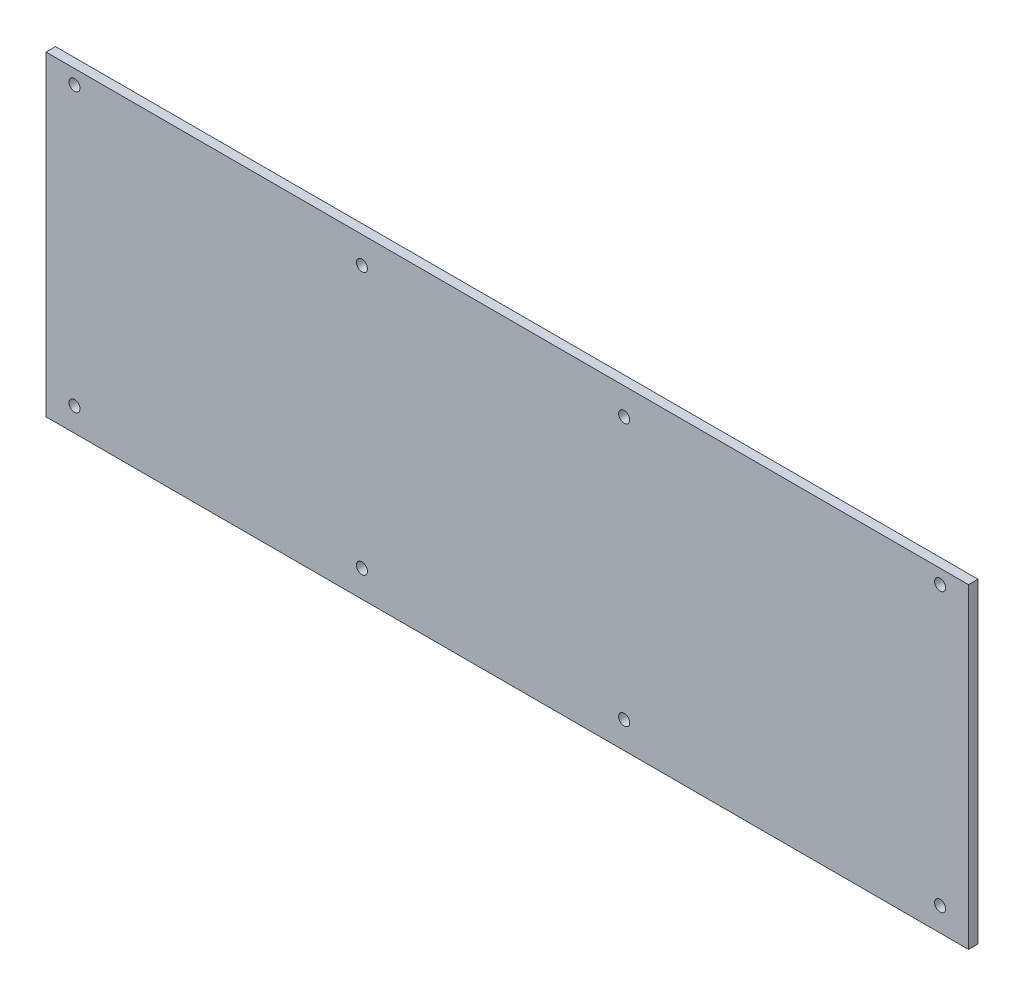
ISO-10303-21;
HEADER;
FILE_DESCRIPTION(('STEP AP214'),'2;1');
FILE_NAME('part.step','',(''),(''),'','','');
FILE_SCHEMA(('AUTOMOTIVE_DESIGN { 1 0 10303 214 1 1 1 1 }'));
ENDSEC;
DATA;
#1=APPLICATION_CONTEXT('core data for automotive mechanical design processes');
#2=APPLICATION_PROTOCOL_DEFINITION('international standard','automotive_design',2000,#1);
#3=PRODUCT_CONTEXT('',#1,'mechanical');
#4=PRODUCT('Part','Part','',(#3));
#5=PRODUCT_RELATED_PRODUCT_CATEGORY('part','',(#4));
#6=PRODUCT_DEFINITION_FORMATION('','',#4);
#7=PRODUCT_DEFINITION_CONTEXT('part definition',#1,'design');
#8=PRODUCT_DEFINITION('design','',#6,#7);
#9=PRODUCT_DEFINITION_SHAPE('','',#8);
#10=(LENGTH_UNIT() NAMED_UNIT(*) SI_UNIT(.MILLI.,.METRE.));
#11=(NAMED_UNIT(*) PLANE_ANGLE_UNIT() SI_UNIT($,.RADIAN.));
#12=(NAMED_UNIT(*) SI_UNIT($,.STERADIAN.) SOLID_ANGLE_UNIT());
#13=UNCERTAINTY_MEASURE_WITH_UNIT(LENGTH_MEASURE(1.E-05),#10,'distance_accuracy_value','');
#14=(GEOMETRIC_REPRESENTATION_CONTEXT(3) GLOBAL_UNCERTAINTY_ASSIGNED_CONTEXT((#13)) GLOBAL_UNIT_ASSIGNED_CONTEXT((#10,
#11,#12)) REPRESENTATION_CONTEXT('',''));
#15=CARTESIAN_POINT('',(0.,0.,0.));
#16=DIRECTION('',(0.,0.,1.));
#17=DIRECTION('',(1.,0.,0.));
#18=AXIS2_PLACEMENT_3D('',#15,#16,#17);
#19=CARTESIAN_POINT('',(0.,0.,3.));
#20=DIRECTION('',(0.,1.,0.));
#21=DIRECTION('',(0.,0.,1.));
#22=AXIS2_PLACEMENT_3D('',#19,#20,#21);
#23=PLANE('',#22);
#24=DIRECTION('',(1.,0.,0.));
#25=VECTOR('',#24,1.);
#26=CARTESIAN_POINT('',(0.,0.,3.));
#27=LINE('',#26,#25);
#28=CARTESIAN_POINT('',(7.99999999999999,0.,3.));
#29=VERTEX_POINT('',#28);
#30=CARTESIAN_POINT('',(300.,0.,3.));
#31=VERTEX_POINT('',#30);
#32=EDGE_CURVE('E92',#29,#31,#27,.T.);
#33=ORIENTED_EDGE('',*,*,#32,.F.);
#34=DIRECTION('',(0.,0.,-1.));
#35=VECTOR('',#34,1.);
#36=CARTESIAN_POINT('',(7.99999999999999,0.,10.));
#37=LINE('',#36,#35);
#38=CARTESIAN_POINT('',(7.99999999999999,0.,0.));
#39=VERTEX_POINT('',#38);
#40=EDGE_CURVE('E108',#29,#39,#37,.T.);
#41=ORIENTED_EDGE('',*,*,#40,.T.);
#42=DIRECTION('',(1.,0.,0.));
#43=VECTOR('',#42,1.);
#44=CARTESIAN_POINT('',(0.,0.,0.));
#45=LINE('',#44,#43);
#46=CARTESIAN_POINT('',(300.,0.,0.));
#47=VERTEX_POINT('',#46);
#48=EDGE_CURVE('E82',#39,#47,#45,.T.);
#49=ORIENTED_EDGE('',*,*,#48,.T.);
#50=DIRECTION('',(0.,0.,-1.));
#51=VECTOR('',#50,1.);
#52=CARTESIAN_POINT('',(300.,0.,3.));
#53=LINE('',#52,#51);
#54=EDGE_CURVE('E11',#31,#47,#53,.T.);
#55=ORIENTED_EDGE('',*,*,#54,.F.);
#56=EDGE_LOOP('',(#33,#41,#49,#55));
#57=FACE_BOUND('',#56,.T.);
#58=ADVANCED_FACE('F36',(#57),#23,.F.);
#59=CARTESIAN_POINT('',(300.,0.,3.));
#60=DIRECTION('',(-1.,0.,0.));
#61=DIRECTION('',(0.,0.,1.));
#62=AXIS2_PLACEMENT_3D('',#59,#60,#61);
#63=PLANE('',#62);
#64=DIRECTION('',(0.,1.,0.));
#65=VECTOR('',#64,1.);
#66=CARTESIAN_POINT('',(300.,0.,0.));
#67=LINE('',#66,#65);
#68=CARTESIAN_POINT('',(300.,100.,0.));
#69=VERTEX_POINT('',#68);
#70=EDGE_CURVE('E72',#47,#69,#67,.T.);
#71=ORIENTED_EDGE('',*,*,#70,.T.);
#72=DIRECTION('',(0.,0.,-1.));
#73=VECTOR('',#72,1.);
#74=CARTESIAN_POINT('',(300.,100.,3.));
#75=LINE('',#74,#73);
#76=CARTESIAN_POINT('',(300.,100.,3.));
#77=VERTEX_POINT('',#76);
#78=EDGE_CURVE('E44',#77,#69,#75,.T.);
#79=ORIENTED_EDGE('',*,*,#78,.F.);
#80=DIRECTION('',(0.,1.,0.));
#81=VECTOR('',#80,1.);
#82=CARTESIAN_POINT('',(300.,0.,3.));
#83=LINE('',#82,#81);
#84=EDGE_CURVE('E60',#31,#77,#83,.T.);
#85=ORIENTED_EDGE('',*,*,#84,.F.);
#86=ORIENTED_EDGE('',*,*,#54,.T.);
#87=EDGE_LOOP('',(#71,#79,#85,#86));
#88=FACE_BOUND('',#87,.T.);
#89=ADVANCED_FACE('F74',(#88),#63,.F.);
#90=CARTESIAN_POINT('',(0.,100.,3.));
#91=DIRECTION('',(0.,-1.,0.));
#92=DIRECTION('',(0.,0.,-1.));
#93=AXIS2_PLACEMENT_3D('',#90,#91,#92);
#94=PLANE('',#93);
#95=DIRECTION('',(-1.,0.,0.));
#96=VECTOR('',#95,1.);
#97=CARTESIAN_POINT('',(0.,100.,0.));
#98=LINE('',#97,#96);
#99=CARTESIAN_POINT('',(8.,100.,0.));
#100=VERTEX_POINT('',#99);
#101=EDGE_CURVE('E81',#69,#100,#98,.T.);
#102=ORIENTED_EDGE('',*,*,#101,.T.);
#103=DIRECTION('',(0.,0.,-1.));
#104=VECTOR('',#103,1.);
#105=CARTESIAN_POINT('',(8.,100.,10.));
#106=LINE('',#105,#104);
#107=CARTESIAN_POINT('',(8.,100.,3.));
#108=VERTEX_POINT('',#107);
#109=EDGE_CURVE('E51',#108,#100,#106,.T.);
#110=ORIENTED_EDGE('',*,*,#109,.F.);
#111=DIRECTION('',(-1.,0.,0.));
#112=VECTOR('',#111,1.);
#113=CARTESIAN_POINT('',(0.,100.,3.));
#114=LINE('',#113,#112);
#115=EDGE_CURVE('E87',#77,#108,#114,.T.);
#116=ORIENTED_EDGE('',*,*,#115,.F.);
#117=ORIENTED_EDGE('',*,*,#78,.T.);
#118=EDGE_LOOP('',(#102,#110,#116,#117));
#119=FACE_BOUND('',#118,.T.);
#120=ADVANCED_FACE('F86',(#119),#94,.F.);
#121=CARTESIAN_POINT('',(0.,0.,3.));
#122=DIRECTION('',(0.,0.,-1.));
#123=DIRECTION('',(-1.,0.,0.));
#124=AXIS2_PLACEMENT_3D('',#121,#122,#123);
#125=PLANE('',#124);
#126=CARTESIAN_POINT('',(191.,91.5,3.));
#127=DIRECTION('',(0.,0.,-1.));
#128=DIRECTION('',(1.,0.,0.));
#129=AXIS2_PLACEMENT_3D('',#126,#127,#128);
#130=CIRCLE('',#129,1.75000000000001);
#131=CARTESIAN_POINT('',(192.75,91.5,3.));
#132=VERTEX_POINT('',#131);
#133=EDGE_CURVE('E153',#132,#132,#130,.T.);
#134=ORIENTED_EDGE('',*,*,#133,.T.);
#135=EDGE_LOOP('',(#134));
#136=FACE_BOUND('',#135,.T.);
#137=CARTESIAN_POINT('',(191.,8.50000000000002,3.));
#138=DIRECTION('',(0.,0.,-1.));
#139=DIRECTION('',(-1.,0.,0.));
#140=AXIS2_PLACEMENT_3D('',#137,#138,#139);
#141=CIRCLE('',#140,1.75000000000001);
#142=CARTESIAN_POINT('',(189.25,8.50000000000002,3.));
#143=VERTEX_POINT('',#142);
#144=EDGE_CURVE('E169',#143,#143,#141,.T.);
#145=ORIENTED_EDGE('',*,*,#144,.T.);
#146=EDGE_LOOP('',(#145));
#147=FACE_BOUND('',#146,.T.);
#148=CARTESIAN_POINT('',(108.,8.50000000000002,3.));
#149=DIRECTION('',(0.,0.,-1.));
#150=DIRECTION('',(1.,0.,0.));
#151=AXIS2_PLACEMENT_3D('',#148,#149,#150);
#152=CIRCLE('',#151,1.75);
#153=CARTESIAN_POINT('',(109.75,8.50000000000002,3.));
#154=VERTEX_POINT('',#153);
#155=EDGE_CURVE('E161',#154,#154,#152,.T.);
#156=ORIENTED_EDGE('',*,*,#155,.T.);
#157=EDGE_LOOP('',(#156));
#158=FACE_BOUND('',#157,.T.);
#159=CARTESIAN_POINT('',(108.,91.5,3.));
#160=DIRECTION('',(0.,0.,-1.));
#161=DIRECTION('',(-1.,0.,0.));
#162=AXIS2_PLACEMENT_3D('',#159,#160,#161);
#163=CIRCLE('',#162,1.75);
#164=CARTESIAN_POINT('',(106.25,91.5,3.));
#165=VERTEX_POINT('',#164);
#166=EDGE_CURVE('E130',#165,#165,#163,.T.);
#167=ORIENTED_EDGE('',*,*,#166,.T.);
#168=EDGE_LOOP('',(#167));
#169=FACE_BOUND('',#168,.T.);
#170=CARTESIAN_POINT('',(17.,95.5,3.));
#171=DIRECTION('',(0.,0.,-1.));
#172=DIRECTION('',(1.,0.,0.));
#173=AXIS2_PLACEMENT_3D('',#170,#171,#172);
#174=CIRCLE('',#173,1.74999999999998);
#175=CARTESIAN_POINT('',(18.75,95.5,3.));
#176=VERTEX_POINT('',#175);
#177=EDGE_CURVE('E121',#176,#176,#174,.T.);
#178=ORIENTED_EDGE('',*,*,#177,.T.);
#179=EDGE_LOOP('',(#178));
#180=FACE_BOUND('',#179,.T.);
#181=CARTESIAN_POINT('',(17.,7.49999999999998,3.));
#182=DIRECTION('',(0.,0.,-1.));
#183=DIRECTION('',(-1.,0.,0.));
#184=AXIS2_PLACEMENT_3D('',#181,#182,#183);
#185=CIRCLE('',#184,1.74999999999998);
#186=CARTESIAN_POINT('',(15.25,7.49999999999998,3.));
#187=VERTEX_POINT('',#186);
#188=EDGE_CURVE('E138',#187,#187,#185,.T.);
#189=ORIENTED_EDGE('',*,*,#188,.T.);
#190=EDGE_LOOP('',(#189));
#191=FACE_BOUND('',#190,.T.);
#192=CARTESIAN_POINT('',(291.,7.49999999999994,3.));
#193=DIRECTION('',(0.,0.,-1.));
#194=DIRECTION('',(1.,0.,0.));
#195=AXIS2_PLACEMENT_3D('',#192,#193,#194);
#196=CIRCLE('',#195,1.74999999999998);
#197=CARTESIAN_POINT('',(292.75,7.49999999999994,3.));
#198=VERTEX_POINT('',#197);
#199=EDGE_CURVE('E129',#198,#198,#196,.T.);
#200=ORIENTED_EDGE('',*,*,#199,.T.);
#201=EDGE_LOOP('',(#200));
#202=FACE_BOUND('',#201,.T.);
#203=CARTESIAN_POINT('',(291.,95.5,3.));
#204=DIRECTION('',(0.,0.,-1.));
#205=DIRECTION('',(-1.,0.,0.));
#206=AXIS2_PLACEMENT_3D('',#203,#204,#205);
#207=CIRCLE('',#206,1.74999999999998);
#208=CARTESIAN_POINT('',(289.25,95.5,3.));
#209=VERTEX_POINT('',#208);
#210=EDGE_CURVE('E116',#209,#209,#207,.T.);
#211=ORIENTED_EDGE('',*,*,#210,.T.);
#212=EDGE_LOOP('',(#211));
#213=FACE_BOUND('',#212,.T.);
#214=ORIENTED_EDGE('',*,*,#115,.T.);
#215=DIRECTION('',(0.,-1.,0.));
#216=VECTOR('',#215,1.);
#217=CARTESIAN_POINT('',(7.99999999999999,0.,3.));
#218=LINE('',#217,#216);
#219=EDGE_CURVE('E100',#108,#29,#218,.T.);
#220=ORIENTED_EDGE('',*,*,#219,.T.);
#221=ORIENTED_EDGE('',*,*,#32,.T.);
#222=ORIENTED_EDGE('',*,*,#84,.T.);
#223=EDGE_LOOP('',(#214,#220,#221,#222));
#224=FACE_BOUND('',#223,.T.);
#225=ADVANCED_FACE('F180',(#136,#147,#158,#169,#180,#191,#202,#213,#224),#125,.F.);
#226=CARTESIAN_POINT('',(0.,0.,0.));
#227=DIRECTION('',(0.,0.,-1.));
#228=DIRECTION('',(-1.,0.,0.));
#229=AXIS2_PLACEMENT_3D('',#226,#227,#228);
#230=PLANE('',#229);
#231=CARTESIAN_POINT('',(191.,91.5,0.));
#232=DIRECTION('',(0.,0.,-1.));
#233=DIRECTION('',(1.,0.,0.));
#234=AXIS2_PLACEMENT_3D('',#231,#232,#233);
#235=CIRCLE('',#234,1.75000000000001);
#236=CARTESIAN_POINT('',(192.75,91.5,0.));
#237=VERTEX_POINT('',#236);
#238=EDGE_CURVE('E172',#237,#237,#235,.T.);
#239=ORIENTED_EDGE('',*,*,#238,.F.);
#240=EDGE_LOOP('',(#239));
#241=FACE_BOUND('',#240,.T.);
#242=CARTESIAN_POINT('',(191.,8.50000000000002,0.));
#243=DIRECTION('',(0.,0.,-1.));
#244=DIRECTION('',(-1.,0.,0.));
#245=AXIS2_PLACEMENT_3D('',#242,#243,#244);
#246=CIRCLE('',#245,1.75000000000001);
#247=CARTESIAN_POINT('',(189.25,8.50000000000002,0.));
#248=VERTEX_POINT('',#247);
#249=EDGE_CURVE('E165',#248,#248,#246,.T.);
#250=ORIENTED_EDGE('',*,*,#249,.F.);
#251=EDGE_LOOP('',(#250));
#252=FACE_BOUND('',#251,.T.);
#253=CARTESIAN_POINT('',(108.,8.50000000000002,0.));
#254=DIRECTION('',(0.,0.,-1.));
#255=DIRECTION('',(1.,0.,0.));
#256=AXIS2_PLACEMENT_3D('',#253,#254,#255);
#257=CIRCLE('',#256,1.75);
#258=CARTESIAN_POINT('',(109.75,8.50000000000002,0.));
#259=VERTEX_POINT('',#258);
#260=EDGE_CURVE('E157',#259,#259,#257,.T.);
#261=ORIENTED_EDGE('',*,*,#260,.F.);
#262=EDGE_LOOP('',(#261));
#263=FACE_BOUND('',#262,.T.);
#264=CARTESIAN_POINT('',(108.,91.5,0.));
#265=DIRECTION('',(0.,0.,-1.));
#266=DIRECTION('',(-1.,0.,0.));
#267=AXIS2_PLACEMENT_3D('',#264,#265,#266);
#268=CIRCLE('',#267,1.75);
#269=CARTESIAN_POINT('',(106.25,91.5,0.));
#270=VERTEX_POINT('',#269);
#271=EDGE_CURVE('E149',#270,#270,#268,.T.);
#272=ORIENTED_EDGE('',*,*,#271,.F.);
#273=EDGE_LOOP('',(#272));
#274=FACE_BOUND('',#273,.T.);
#275=CARTESIAN_POINT('',(17.,95.5,0.));
#276=DIRECTION('',(0.,0.,-1.));
#277=DIRECTION('',(1.,0.,0.));
#278=AXIS2_PLACEMENT_3D('',#275,#276,#277);
#279=CIRCLE('',#278,1.74999999999998);
#280=CARTESIAN_POINT('',(18.75,95.5,0.));
#281=VERTEX_POINT('',#280);
#282=EDGE_CURVE('E142',#281,#281,#279,.T.);
#283=ORIENTED_EDGE('',*,*,#282,.F.);
#284=EDGE_LOOP('',(#283));
#285=FACE_BOUND('',#284,.T.);
#286=CARTESIAN_POINT('',(17.,7.49999999999998,0.));
#287=DIRECTION('',(0.,0.,-1.));
#288=DIRECTION('',(-1.,0.,0.));
#289=AXIS2_PLACEMENT_3D('',#286,#287,#288);
#290=CIRCLE('',#289,1.74999999999998);
#291=CARTESIAN_POINT('',(15.25,7.49999999999998,0.));
#292=VERTEX_POINT('',#291);
#293=EDGE_CURVE('E134',#292,#292,#290,.T.);
#294=ORIENTED_EDGE('',*,*,#293,.F.);
#295=EDGE_LOOP('',(#294));
#296=FACE_BOUND('',#295,.T.);
#297=CARTESIAN_POINT('',(291.,7.49999999999994,0.));
#298=DIRECTION('',(0.,0.,-1.));
#299=DIRECTION('',(1.,0.,0.));
#300=AXIS2_PLACEMENT_3D('',#297,#298,#299);
#301=CIRCLE('',#300,1.74999999999998);
#302=CARTESIAN_POINT('',(292.75,7.49999999999994,0.));
#303=VERTEX_POINT('',#302);
#304=EDGE_CURVE('E125',#303,#303,#301,.T.);
#305=ORIENTED_EDGE('',*,*,#304,.F.);
#306=EDGE_LOOP('',(#305));
#307=FACE_BOUND('',#306,.T.);
#308=CARTESIAN_POINT('',(291.,95.5,0.));
#309=DIRECTION('',(0.,0.,-1.));
#310=DIRECTION('',(-1.,0.,0.));
#311=AXIS2_PLACEMENT_3D('',#308,#309,#310);
#312=CIRCLE('',#311,1.74999999999998);
#313=CARTESIAN_POINT('',(289.25,95.5,0.));
#314=VERTEX_POINT('',#313);
#315=EDGE_CURVE('E117',#314,#314,#312,.T.);
#316=ORIENTED_EDGE('',*,*,#315,.F.);
#317=EDGE_LOOP('',(#316));
#318=FACE_BOUND('',#317,.T.);
#319=DIRECTION('',(0.,-1.,0.));
#320=VECTOR('',#319,1.);
#321=CARTESIAN_POINT('',(8.,100.,0.));
#322=LINE('',#321,#320);
#323=EDGE_CURVE('E90',#100,#39,#322,.T.);
#324=ORIENTED_EDGE('',*,*,#323,.F.);
#325=ORIENTED_EDGE('',*,*,#101,.F.);
#326=ORIENTED_EDGE('',*,*,#70,.F.);
#327=ORIENTED_EDGE('',*,*,#48,.F.);
#328=EDGE_LOOP('',(#324,#325,#326,#327));
#329=FACE_BOUND('',#328,.T.);
#330=ADVANCED_FACE('F89',(#241,#252,#263,#274,#285,#296,#307,#318,#329),#230,.T.);
#331=CARTESIAN_POINT('',(8.,100.,10.));
#332=DIRECTION('',(1.,0.,0.));
#333=DIRECTION('',(0.,1.,0.));
#334=AXIS2_PLACEMENT_3D('',#331,#332,#333);
#335=PLANE('',#334);
#336=ORIENTED_EDGE('',*,*,#109,.T.);
#337=ORIENTED_EDGE('',*,*,#323,.T.);
#338=ORIENTED_EDGE('',*,*,#40,.F.);
#339=ORIENTED_EDGE('',*,*,#219,.F.);
#340=EDGE_LOOP('',(#336,#337,#338,#339));
#341=FACE_BOUND('',#340,.T.);
#342=ADVANCED_FACE('F192',(#341),#335,.F.);
#343=CARTESIAN_POINT('',(291.,95.5,3.));
#344=DIRECTION('',(0.,0.,-1.));
#345=DIRECTION('',(-1.,0.,0.));
#346=AXIS2_PLACEMENT_3D('',#343,#344,#345);
#347=CYLINDRICAL_SURFACE('',#346,1.74999999999998);
#348=ORIENTED_EDGE('',*,*,#210,.F.);
#349=EDGE_LOOP('',(#348));
#350=FACE_BOUND('',#349,.T.);
#351=ORIENTED_EDGE('',*,*,#315,.T.);
#352=EDGE_LOOP('',(#351));
#353=FACE_BOUND('',#352,.T.);
#354=ADVANCED_FACE('F208',(#350,#353),#347,.F.);
#355=CARTESIAN_POINT('',(291.,7.49999999999994,3.));
#356=DIRECTION('',(0.,0.,-1.));
#357=DIRECTION('',(-1.,0.,0.));
#358=AXIS2_PLACEMENT_3D('',#355,#356,#357);
#359=CYLINDRICAL_SURFACE('',#358,1.74999999999998);
#360=ORIENTED_EDGE('',*,*,#199,.F.);
#361=EDGE_LOOP('',(#360));
#362=FACE_BOUND('',#361,.T.);
#363=ORIENTED_EDGE('',*,*,#304,.T.);
#364=EDGE_LOOP('',(#363));
#365=FACE_BOUND('',#364,.T.);
#366=ADVANCED_FACE('F210',(#362,#365),#359,.F.);
#367=CARTESIAN_POINT('',(17.,7.49999999999998,3.));
#368=DIRECTION('',(0.,0.,-1.));
#369=DIRECTION('',(-1.,0.,0.));
#370=AXIS2_PLACEMENT_3D('',#367,#368,#369);
#371=CYLINDRICAL_SURFACE('',#370,1.74999999999998);
#372=ORIENTED_EDGE('',*,*,#188,.F.);
#373=EDGE_LOOP('',(#372));
#374=FACE_BOUND('',#373,.T.);
#375=ORIENTED_EDGE('',*,*,#293,.T.);
#376=EDGE_LOOP('',(#375));
#377=FACE_BOUND('',#376,.T.);
#378=ADVANCED_FACE('F216',(#374,#377),#371,.F.);
#379=CARTESIAN_POINT('',(17.,95.5,3.));
#380=DIRECTION('',(0.,0.,-1.));
#381=DIRECTION('',(-1.,0.,0.));
#382=AXIS2_PLACEMENT_3D('',#379,#380,#381);
#383=CYLINDRICAL_SURFACE('',#382,1.74999999999998);
#384=ORIENTED_EDGE('',*,*,#177,.F.);
#385=EDGE_LOOP('',(#384));
#386=FACE_BOUND('',#385,.T.);
#387=ORIENTED_EDGE('',*,*,#282,.T.);
#388=EDGE_LOOP('',(#387));
#389=FACE_BOUND('',#388,.T.);
#390=ADVANCED_FACE('F284',(#386,#389),#383,.F.);
#391=CARTESIAN_POINT('',(108.,91.5,3.));
#392=DIRECTION('',(0.,0.,-1.));
#393=DIRECTION('',(-1.,0.,0.));
#394=AXIS2_PLACEMENT_3D('',#391,#392,#393);
#395=CYLINDRICAL_SURFACE('',#394,1.75);
#396=ORIENTED_EDGE('',*,*,#166,.F.);
#397=EDGE_LOOP('',(#396));
#398=FACE_BOUND('',#397,.T.);
#399=ORIENTED_EDGE('',*,*,#271,.T.);
#400=EDGE_LOOP('',(#399));
#401=FACE_BOUND('',#400,.T.);
#402=ADVANCED_FACE('F294',(#398,#401),#395,.F.);
#403=CARTESIAN_POINT('',(108.,8.50000000000002,3.));
#404=DIRECTION('',(0.,0.,-1.));
#405=DIRECTION('',(-1.,0.,0.));
#406=AXIS2_PLACEMENT_3D('',#403,#404,#405);
#407=CYLINDRICAL_SURFACE('',#406,1.75);
#408=ORIENTED_EDGE('',*,*,#155,.F.);
#409=EDGE_LOOP('',(#408));
#410=FACE_BOUND('',#409,.T.);
#411=ORIENTED_EDGE('',*,*,#260,.T.);
#412=EDGE_LOOP('',(#411));
#413=FACE_BOUND('',#412,.T.);
#414=ADVANCED_FACE('F311',(#410,#413),#407,.F.);
#415=CARTESIAN_POINT('',(191.,8.50000000000002,3.));
#416=DIRECTION('',(0.,0.,-1.));
#417=DIRECTION('',(-1.,0.,0.));
#418=AXIS2_PLACEMENT_3D('',#415,#416,#417);
#419=CYLINDRICAL_SURFACE('',#418,1.75000000000001);
#420=ORIENTED_EDGE('',*,*,#144,.F.);
#421=EDGE_LOOP('',(#420));
#422=FACE_BOUND('',#421,.T.);
#423=ORIENTED_EDGE('',*,*,#249,.T.);
#424=EDGE_LOOP('',(#423));
#425=FACE_BOUND('',#424,.T.);
#426=ADVANCED_FACE('F186',(#422,#425),#419,.F.);
#427=CARTESIAN_POINT('',(191.,91.5,3.));
#428=DIRECTION('',(0.,0.,-1.));
#429=DIRECTION('',(-1.,0.,0.));
#430=AXIS2_PLACEMENT_3D('',#427,#428,#429);
#431=CYLINDRICAL_SURFACE('',#430,1.75000000000001);
#432=ORIENTED_EDGE('',*,*,#133,.F.);
#433=EDGE_LOOP('',(#432));
#434=FACE_BOUND('',#433,.T.);
#435=ORIENTED_EDGE('',*,*,#238,.T.);
#436=EDGE_LOOP('',(#435));
#437=FACE_BOUND('',#436,.T.);
#438=ADVANCED_FACE('F183',(#434,#437),#431,.F.);
#439=CLOSED_SHELL('',(#58,#89,#120,#225,#330,#342,#354,#366,#378,#390,#402,#414,#426,#438));
#440=MANIFOLD_SOLID_BREP('B2',#439);
#441=ADVANCED_BREP_SHAPE_REPRESENTATION('',(#18,#440),#14);
#442=SHAPE_DEFINITION_REPRESENTATION(#9,#441);
ENDSEC;
END-ISO-10303-21;
